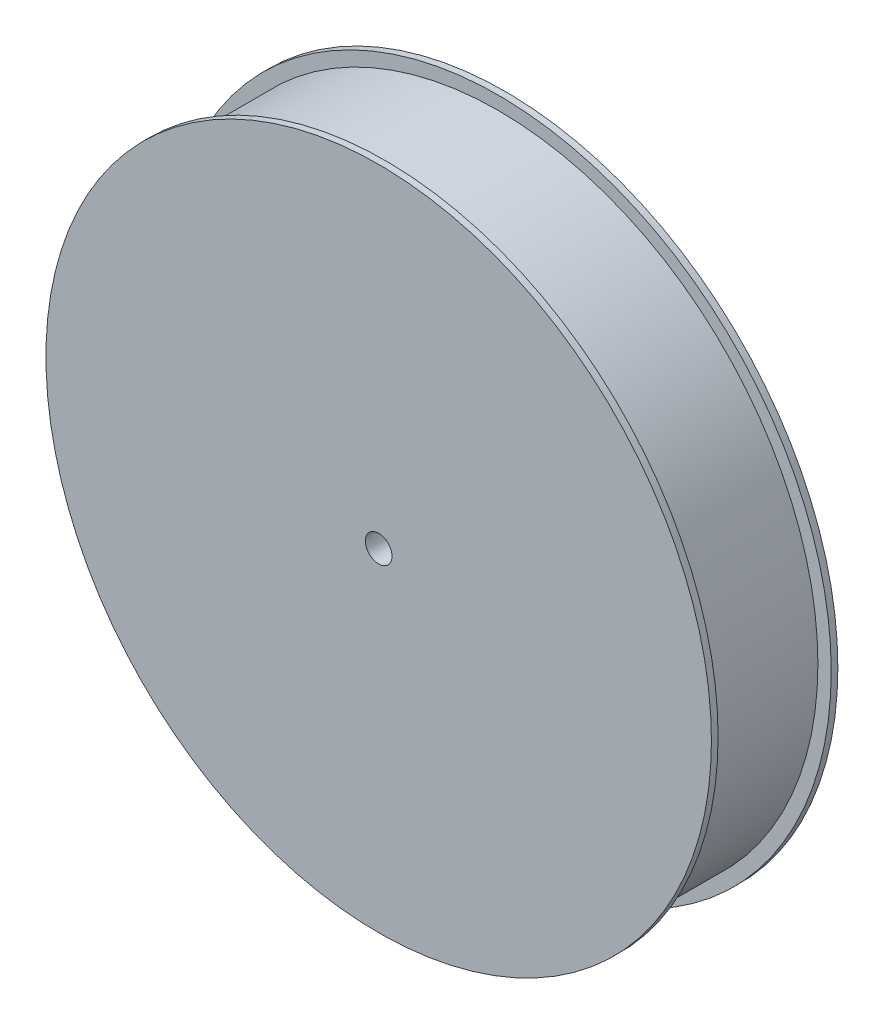
ISO-10303-21;
HEADER;
FILE_DESCRIPTION(('STEP AP214'),'2;1');
FILE_NAME('part.step','',(''),(''),'','','');
FILE_SCHEMA(('AUTOMOTIVE_DESIGN { 1 0 10303 214 1 1 1 1 }'));
ENDSEC;
DATA;
#1=APPLICATION_CONTEXT('core data for automotive mechanical design processes');
#2=APPLICATION_PROTOCOL_DEFINITION('international standard','automotive_design',2000,#1);
#3=PRODUCT_CONTEXT('',#1,'mechanical');
#4=PRODUCT('Part','Part','',(#3));
#5=PRODUCT_RELATED_PRODUCT_CATEGORY('part','',(#4));
#6=PRODUCT_DEFINITION_FORMATION('','',#4);
#7=PRODUCT_DEFINITION_CONTEXT('part definition',#1,'design');
#8=PRODUCT_DEFINITION('design','',#6,#7);
#9=PRODUCT_DEFINITION_SHAPE('','',#8);
#10=(LENGTH_UNIT() NAMED_UNIT(*) SI_UNIT(.MILLI.,.METRE.));
#11=(NAMED_UNIT(*) PLANE_ANGLE_UNIT() SI_UNIT($,.RADIAN.));
#12=(NAMED_UNIT(*) SI_UNIT($,.STERADIAN.) SOLID_ANGLE_UNIT());
#13=UNCERTAINTY_MEASURE_WITH_UNIT(LENGTH_MEASURE(1.E-05),#10,'distance_accuracy_value','');
#14=(GEOMETRIC_REPRESENTATION_CONTEXT(3) GLOBAL_UNCERTAINTY_ASSIGNED_CONTEXT((#13)) GLOBAL_UNIT_ASSIGNED_CONTEXT((#10,
#11,#12)) REPRESENTATION_CONTEXT('',''));
#15=CARTESIAN_POINT('',(0.,0.,0.));
#16=DIRECTION('',(0.,0.,1.));
#17=DIRECTION('',(1.,0.,0.));
#18=AXIS2_PLACEMENT_3D('',#15,#16,#17);
#19=CARTESIAN_POINT('',(0.,0.,13.49375));
#20=DIRECTION('',(0.,0.,-1.));
#21=DIRECTION('',(-1.,0.,0.));
#22=AXIS2_PLACEMENT_3D('',#19,#20,#21);
#23=CYLINDRICAL_SURFACE('',#22,76.2);
#24=CARTESIAN_POINT('',(0.,0.,13.49375));
#25=DIRECTION('',(0.,0.,1.));
#26=DIRECTION('',(1.,0.,0.));
#27=AXIS2_PLACEMENT_3D('',#24,#25,#26);
#28=CIRCLE('',#27,76.2);
#29=CARTESIAN_POINT('',(76.2,0.,13.49375));
#30=VERTEX_POINT('',#29);
#31=EDGE_CURVE('E10',#30,#30,#28,.T.);
#32=ORIENTED_EDGE('',*,*,#31,.F.);
#33=EDGE_LOOP('',(#32));
#34=FACE_BOUND('',#33,.T.);
#35=CARTESIAN_POINT('',(0.,0.,-13.49375));
#36=DIRECTION('',(0.,0.,1.));
#37=DIRECTION('',(1.,0.,0.));
#38=AXIS2_PLACEMENT_3D('',#35,#36,#37);
#39=CIRCLE('',#38,76.2);
#40=CARTESIAN_POINT('',(76.2,0.,-13.49375));
#41=VERTEX_POINT('',#40);
#42=EDGE_CURVE('E45',#41,#41,#39,.T.);
#43=ORIENTED_EDGE('',*,*,#42,.T.);
#44=EDGE_LOOP('',(#43));
#45=FACE_BOUND('',#44,.T.);
#46=ADVANCED_FACE('F30',(#34,#45),#23,.T.);
#47=CARTESIAN_POINT('',(0.,0.,13.49375));
#48=DIRECTION('',(0.,0.,1.));
#49=DIRECTION('',(1.,0.,0.));
#50=AXIS2_PLACEMENT_3D('',#47,#48,#49);
#51=PLANE('',#50);
#52=CARTESIAN_POINT('',(0.,0.,13.49375));
#53=DIRECTION('',(0.,0.,1.));
#54=DIRECTION('',(1.,0.,0.));
#55=AXIS2_PLACEMENT_3D('',#52,#53,#54);
#56=CIRCLE('',#55,79.375);
#57=CARTESIAN_POINT('',(79.375,0.,13.49375));
#58=VERTEX_POINT('',#57);
#59=EDGE_CURVE('E40',#58,#58,#56,.T.);
#60=ORIENTED_EDGE('',*,*,#59,.F.);
#61=EDGE_LOOP('',(#60));
#62=FACE_BOUND('',#61,.T.);
#63=ORIENTED_EDGE('',*,*,#31,.T.);
#64=EDGE_LOOP('',(#63));
#65=FACE_BOUND('',#64,.T.);
#66=ADVANCED_FACE('F83',(#62,#65),#51,.F.);
#67=CARTESIAN_POINT('',(0.,0.,15.08125));
#68=DIRECTION('',(0.,0.,-1.));
#69=DIRECTION('',(-1.,0.,0.));
#70=AXIS2_PLACEMENT_3D('',#67,#68,#69);
#71=CYLINDRICAL_SURFACE('',#70,79.375);
#72=CARTESIAN_POINT('',(0.,0.,15.08125));
#73=DIRECTION('',(0.,0.,1.));
#74=DIRECTION('',(1.,0.,0.));
#75=AXIS2_PLACEMENT_3D('',#72,#73,#74);
#76=CIRCLE('',#75,79.375);
#77=CARTESIAN_POINT('',(79.375,0.,15.08125));
#78=VERTEX_POINT('',#77);
#79=EDGE_CURVE('E36',#78,#78,#76,.T.);
#80=ORIENTED_EDGE('',*,*,#79,.F.);
#81=EDGE_LOOP('',(#80));
#82=FACE_BOUND('',#81,.T.);
#83=ORIENTED_EDGE('',*,*,#59,.T.);
#84=EDGE_LOOP('',(#83));
#85=FACE_BOUND('',#84,.T.);
#86=ADVANCED_FACE('F74',(#82,#85),#71,.T.);
#87=CARTESIAN_POINT('',(0.,0.,15.08125));
#88=DIRECTION('',(0.,0.,1.));
#89=DIRECTION('',(1.,0.,0.));
#90=AXIS2_PLACEMENT_3D('',#87,#88,#89);
#91=PLANE('',#90);
#92=CARTESIAN_POINT('',(0.,0.,15.08125));
#93=DIRECTION('',(0.,0.,1.));
#94=DIRECTION('',(1.,0.,0.));
#95=AXIS2_PLACEMENT_3D('',#92,#93,#94);
#96=CIRCLE('',#95,3.175);
#97=CARTESIAN_POINT('',(3.175,0.,15.08125));
#98=VERTEX_POINT('',#97);
#99=EDGE_CURVE('E56',#98,#98,#96,.T.);
#100=ORIENTED_EDGE('',*,*,#99,.F.);
#101=EDGE_LOOP('',(#100));
#102=FACE_BOUND('',#101,.T.);
#103=ORIENTED_EDGE('',*,*,#79,.T.);
#104=EDGE_LOOP('',(#103));
#105=FACE_BOUND('',#104,.T.);
#106=ADVANCED_FACE('F71',(#102,#105),#91,.T.);
#107=CARTESIAN_POINT('',(0.,0.,-13.49375));
#108=DIRECTION('',(0.,0.,-1.));
#109=DIRECTION('',(1.,0.,0.));
#110=AXIS2_PLACEMENT_3D('',#107,#108,#109);
#111=PLANE('',#110);
#112=CARTESIAN_POINT('',(0.,0.,-13.49375));
#113=DIRECTION('',(0.,0.,1.));
#114=DIRECTION('',(1.,0.,0.));
#115=AXIS2_PLACEMENT_3D('',#112,#113,#114);
#116=CIRCLE('',#115,79.375);
#117=CARTESIAN_POINT('',(79.375,0.,-13.49375));
#118=VERTEX_POINT('',#117);
#119=EDGE_CURVE('E50',#118,#118,#116,.T.);
#120=ORIENTED_EDGE('',*,*,#119,.T.);
#121=EDGE_LOOP('',(#120));
#122=FACE_BOUND('',#121,.T.);
#123=ORIENTED_EDGE('',*,*,#42,.F.);
#124=EDGE_LOOP('',(#123));
#125=FACE_BOUND('',#124,.T.);
#126=ADVANCED_FACE('F73',(#122,#125),#111,.F.);
#127=CARTESIAN_POINT('',(0.,0.,-15.08125));
#128=DIRECTION('',(0.,0.,1.));
#129=DIRECTION('',(-1.,0.,0.));
#130=AXIS2_PLACEMENT_3D('',#127,#128,#129);
#131=CYLINDRICAL_SURFACE('',#130,79.375);
#132=CARTESIAN_POINT('',(0.,0.,-15.08125));
#133=DIRECTION('',(0.,0.,1.));
#134=DIRECTION('',(1.,0.,0.));
#135=AXIS2_PLACEMENT_3D('',#132,#133,#134);
#136=CIRCLE('',#135,79.375);
#137=CARTESIAN_POINT('',(79.375,0.,-15.08125));
#138=VERTEX_POINT('',#137);
#139=EDGE_CURVE('E49',#138,#138,#136,.T.);
#140=ORIENTED_EDGE('',*,*,#139,.T.);
#141=EDGE_LOOP('',(#140));
#142=FACE_BOUND('',#141,.T.);
#143=ORIENTED_EDGE('',*,*,#119,.F.);
#144=EDGE_LOOP('',(#143));
#145=FACE_BOUND('',#144,.T.);
#146=ADVANCED_FACE('F80',(#142,#145),#131,.T.);
#147=CARTESIAN_POINT('',(0.,0.,-15.08125));
#148=DIRECTION('',(0.,0.,-1.));
#149=DIRECTION('',(1.,0.,0.));
#150=AXIS2_PLACEMENT_3D('',#147,#148,#149);
#151=PLANE('',#150);
#152=CARTESIAN_POINT('',(0.,0.,-15.08125));
#153=DIRECTION('',(0.,0.,1.));
#154=DIRECTION('',(1.,0.,0.));
#155=AXIS2_PLACEMENT_3D('',#152,#153,#154);
#156=CIRCLE('',#155,3.175);
#157=CARTESIAN_POINT('',(3.175,0.,-15.08125));
#158=VERTEX_POINT('',#157);
#159=EDGE_CURVE('E53',#158,#158,#156,.T.);
#160=ORIENTED_EDGE('',*,*,#159,.T.);
#161=EDGE_LOOP('',(#160));
#162=FACE_BOUND('',#161,.T.);
#163=ORIENTED_EDGE('',*,*,#139,.F.);
#164=EDGE_LOOP('',(#163));
#165=FACE_BOUND('',#164,.T.);
#166=ADVANCED_FACE('F62',(#162,#165),#151,.T.);
#167=CARTESIAN_POINT('',(0.,0.,-15.08125));
#168=DIRECTION('',(0.,0.,1.));
#169=DIRECTION('',(1.,0.,0.));
#170=AXIS2_PLACEMENT_3D('',#167,#168,#169);
#171=CYLINDRICAL_SURFACE('',#170,3.175);
#172=ORIENTED_EDGE('',*,*,#159,.F.);
#173=EDGE_LOOP('',(#172));
#174=FACE_BOUND('',#173,.T.);
#175=ORIENTED_EDGE('',*,*,#99,.T.);
#176=EDGE_LOOP('',(#175));
#177=FACE_BOUND('',#176,.T.);
#178=ADVANCED_FACE('F65',(#174,#177),#171,.F.);
#179=CLOSED_SHELL('',(#46,#66,#86,#106,#126,#146,#166,#178));
#180=MANIFOLD_SOLID_BREP('B2',#179);
#181=ADVANCED_BREP_SHAPE_REPRESENTATION('',(#18,#180),#14);
#182=SHAPE_DEFINITION_REPRESENTATION(#9,#181);
ENDSEC;
END-ISO-10303-21;
